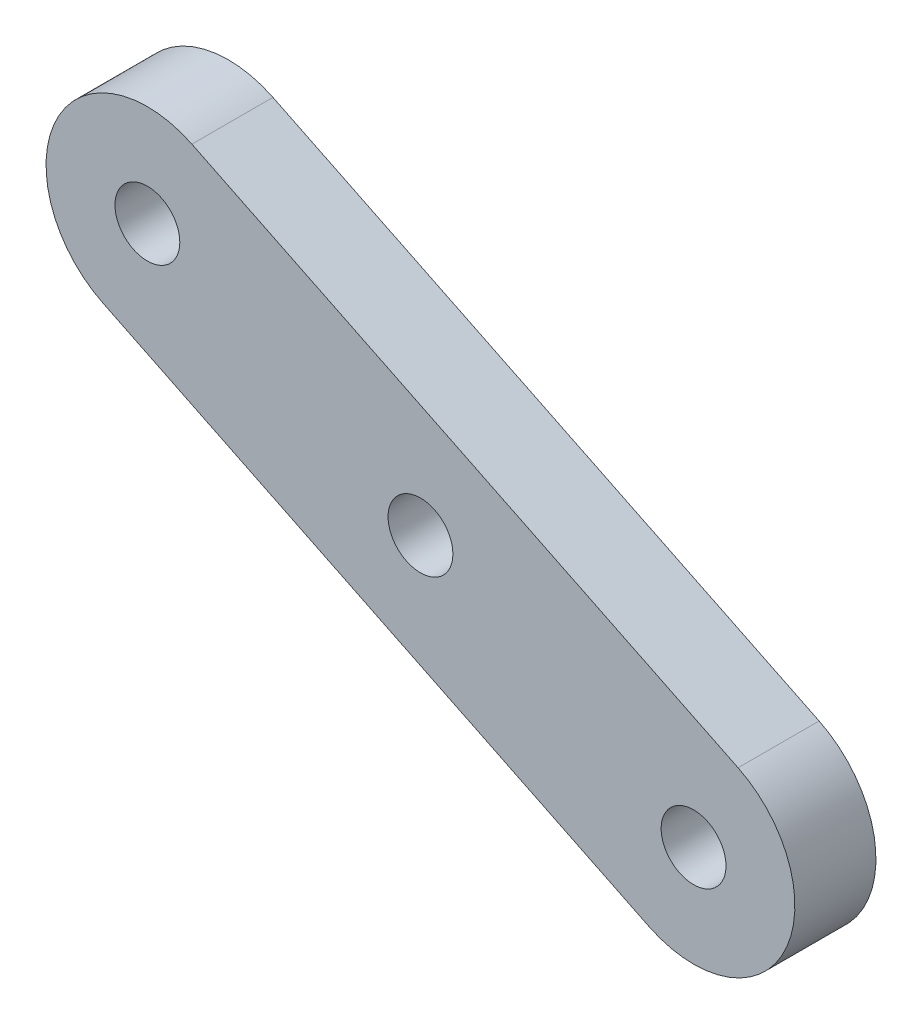
ISO-10303-21;
HEADER;
FILE_DESCRIPTION(('STEP AP214'),'2;1');
FILE_NAME('part.step','',(''),(''),'','','');
FILE_SCHEMA(('AUTOMOTIVE_DESIGN { 1 0 10303 214 1 1 1 1 }'));
ENDSEC;
DATA;
#1=APPLICATION_CONTEXT('core data for automotive mechanical design processes');
#2=APPLICATION_PROTOCOL_DEFINITION('international standard','automotive_design',2000,#1);
#3=PRODUCT_CONTEXT('',#1,'mechanical');
#4=PRODUCT('Part','Part','',(#3));
#5=PRODUCT_RELATED_PRODUCT_CATEGORY('part','',(#4));
#6=PRODUCT_DEFINITION_FORMATION('','',#4);
#7=PRODUCT_DEFINITION_CONTEXT('part definition',#1,'design');
#8=PRODUCT_DEFINITION('design','',#6,#7);
#9=PRODUCT_DEFINITION_SHAPE('','',#8);
#10=(LENGTH_UNIT() NAMED_UNIT(*) SI_UNIT(.MILLI.,.METRE.));
#11=(NAMED_UNIT(*) PLANE_ANGLE_UNIT() SI_UNIT($,.RADIAN.));
#12=(NAMED_UNIT(*) SI_UNIT($,.STERADIAN.) SOLID_ANGLE_UNIT());
#13=UNCERTAINTY_MEASURE_WITH_UNIT(LENGTH_MEASURE(1.E-05),#10,'distance_accuracy_value','');
#14=(GEOMETRIC_REPRESENTATION_CONTEXT(3) GLOBAL_UNCERTAINTY_ASSIGNED_CONTEXT((#13)) GLOBAL_UNIT_ASSIGNED_CONTEXT((#10,
#11,#12)) REPRESENTATION_CONTEXT('',''));
#15=CARTESIAN_POINT('',(0.,0.,0.));
#16=DIRECTION('',(0.,0.,1.));
#17=DIRECTION('',(1.,0.,0.));
#18=AXIS2_PLACEMENT_3D('',#15,#16,#17);
#19=CARTESIAN_POINT('',(0.,0.,4.));
#20=DIRECTION('',(0.,0.,1.));
#21=DIRECTION('',(1.,0.,0.));
#22=AXIS2_PLACEMENT_3D('',#19,#20,#21);
#23=PLANE('',#22);
#24=CARTESIAN_POINT('',(0.,0.,4.));
#25=DIRECTION('',(0.,0.,1.));
#26=DIRECTION('',(1.,0.,0.));
#27=AXIS2_PLACEMENT_3D('',#24,#25,#26);
#28=CIRCLE('',#27,1.6);
#29=CARTESIAN_POINT('',(1.60000000000001,0.,4.));
#30=VERTEX_POINT('',#29);
#31=EDGE_CURVE('E115',#30,#30,#28,.T.);
#32=ORIENTED_EDGE('',*,*,#31,.F.);
#33=EDGE_LOOP('',(#32));
#34=FACE_BOUND('',#33,.T.);
#35=CARTESIAN_POINT('',(0.,0.,4.));
#36=DIRECTION('',(0.,0.,1.));
#37=DIRECTION('',(1.,0.,0.));
#38=AXIS2_PLACEMENT_3D('',#35,#36,#37);
#39=CIRCLE('',#38,5.);
#40=CARTESIAN_POINT('',(-2.19568936266241,-4.4920984208598,4.));
#41=VERTEX_POINT('',#40);
#42=CARTESIAN_POINT('',(2.19568936266242,4.4920984208598,4.));
#43=VERTEX_POINT('',#42);
#44=EDGE_CURVE('E85',#41,#43,#39,.T.);
#45=ORIENTED_EDGE('',*,*,#44,.T.);
#46=DIRECTION('',(-0.898419684171961,0.439137872532482,0.));
#47=VECTOR('',#46,1.);
#48=CARTESIAN_POINT('',(2.19568936266242,4.4920984208598,4.));
#49=LINE('',#48,#47);
#50=CARTESIAN_POINT('',(-24.7569011624964,17.6662345968343,4.));
#51=VERTEX_POINT('',#50);
#52=EDGE_CURVE('E80',#43,#51,#49,.T.);
#53=ORIENTED_EDGE('',*,*,#52,.T.);
#54=CARTESIAN_POINT('',(-26.9525905251588,13.1741361759745,4.));
#55=DIRECTION('',(0.,0.,1.));
#56=DIRECTION('',(1.,0.,0.));
#57=AXIS2_PLACEMENT_3D('',#54,#55,#56);
#58=CIRCLE('',#57,4.99999999999999);
#59=CARTESIAN_POINT('',(-29.1482798878212,8.68203775511466,4.));
#60=VERTEX_POINT('',#59);
#61=EDGE_CURVE('E83',#51,#60,#58,.T.);
#62=ORIENTED_EDGE('',*,*,#61,.T.);
#63=DIRECTION('',(0.89841968417196,-0.439137872532482,0.));
#64=VECTOR('',#63,1.);
#65=CARTESIAN_POINT('',(-2.19568936266241,-4.4920984208598,4.));
#66=LINE('',#65,#64);
#67=EDGE_CURVE('E50',#60,#41,#66,.T.);
#68=ORIENTED_EDGE('',*,*,#67,.T.);
#69=EDGE_LOOP('',(#45,#53,#62,#68));
#70=FACE_BOUND('',#69,.T.);
#71=CARTESIAN_POINT('',(-26.9525905251588,13.1741361759745,4.));
#72=DIRECTION('',(0.,0.,1.));
#73=DIRECTION('',(1.,0.,0.));
#74=AXIS2_PLACEMENT_3D('',#71,#72,#73);
#75=CIRCLE('',#74,1.6);
#76=CARTESIAN_POINT('',(-25.3525905251588,13.1741361759745,4.));
#77=VERTEX_POINT('',#76);
#78=EDGE_CURVE('E100',#77,#77,#75,.T.);
#79=ORIENTED_EDGE('',*,*,#78,.F.);
#80=EDGE_LOOP('',(#79));
#81=FACE_BOUND('',#80,.T.);
#82=CARTESIAN_POINT('',(-13.4762952625794,6.58706808798723,4.));
#83=DIRECTION('',(0.,0.,1.));
#84=DIRECTION('',(1.,0.,0.));
#85=AXIS2_PLACEMENT_3D('',#82,#83,#84);
#86=CIRCLE('',#85,1.6);
#87=CARTESIAN_POINT('',(-11.8762952625794,6.58706808798723,4.));
#88=VERTEX_POINT('',#87);
#89=EDGE_CURVE('E121',#88,#88,#86,.T.);
#90=ORIENTED_EDGE('',*,*,#89,.F.);
#91=EDGE_LOOP('',(#90));
#92=FACE_BOUND('',#91,.T.);
#93=ADVANCED_FACE('F33',(#34,#70,#81,#92),#23,.T.);
#94=CARTESIAN_POINT('',(0.,0.,0.));
#95=DIRECTION('',(0.,0.,1.));
#96=DIRECTION('',(1.,0.,0.));
#97=AXIS2_PLACEMENT_3D('',#94,#95,#96);
#98=PLANE('',#97);
#99=CARTESIAN_POINT('',(0.,0.,0.));
#100=DIRECTION('',(0.,0.,1.));
#101=DIRECTION('',(1.,0.,0.));
#102=AXIS2_PLACEMENT_3D('',#99,#100,#101);
#103=CIRCLE('',#102,5.);
#104=CARTESIAN_POINT('',(-2.19568936266241,-4.4920984208598,0.));
#105=VERTEX_POINT('',#104);
#106=CARTESIAN_POINT('',(2.19568936266242,4.4920984208598,0.));
#107=VERTEX_POINT('',#106);
#108=EDGE_CURVE('E97',#105,#107,#103,.T.);
#109=ORIENTED_EDGE('',*,*,#108,.F.);
#110=DIRECTION('',(0.89841968417196,-0.439137872532482,0.));
#111=VECTOR('',#110,1.);
#112=CARTESIAN_POINT('',(-2.19568936266241,-4.4920984208598,0.));
#113=LINE('',#112,#111);
#114=CARTESIAN_POINT('',(-29.1482798878212,8.68203775511466,0.));
#115=VERTEX_POINT('',#114);
#116=EDGE_CURVE('E73',#115,#105,#113,.T.);
#117=ORIENTED_EDGE('',*,*,#116,.F.);
#118=CARTESIAN_POINT('',(-26.9525905251588,13.1741361759745,0.));
#119=DIRECTION('',(0.,0.,1.));
#120=DIRECTION('',(1.,0.,0.));
#121=AXIS2_PLACEMENT_3D('',#118,#119,#120);
#122=CIRCLE('',#121,4.99999999999999);
#123=CARTESIAN_POINT('',(-24.7569011624964,17.6662345968343,0.));
#124=VERTEX_POINT('',#123);
#125=EDGE_CURVE('E67',#124,#115,#122,.T.);
#126=ORIENTED_EDGE('',*,*,#125,.F.);
#127=DIRECTION('',(-0.898419684171961,0.439137872532482,0.));
#128=VECTOR('',#127,1.);
#129=CARTESIAN_POINT('',(2.19568936266242,4.4920984208598,0.));
#130=LINE('',#129,#128);
#131=EDGE_CURVE('E89',#107,#124,#130,.T.);
#132=ORIENTED_EDGE('',*,*,#131,.F.);
#133=EDGE_LOOP('',(#109,#117,#126,#132));
#134=FACE_BOUND('',#133,.T.);
#135=CARTESIAN_POINT('',(-26.9525905251588,13.1741361759745,0.));
#136=DIRECTION('',(0.,0.,1.));
#137=DIRECTION('',(1.,0.,0.));
#138=AXIS2_PLACEMENT_3D('',#135,#136,#137);
#139=CIRCLE('',#138,1.6);
#140=CARTESIAN_POINT('',(-25.3525905251588,13.1741361759745,0.));
#141=VERTEX_POINT('',#140);
#142=EDGE_CURVE('E112',#141,#141,#139,.T.);
#143=ORIENTED_EDGE('',*,*,#142,.T.);
#144=EDGE_LOOP('',(#143));
#145=FACE_BOUND('',#144,.T.);
#146=CARTESIAN_POINT('',(0.,0.,0.));
#147=DIRECTION('',(0.,0.,1.));
#148=DIRECTION('',(1.,0.,0.));
#149=AXIS2_PLACEMENT_3D('',#146,#147,#148);
#150=CIRCLE('',#149,1.6);
#151=CARTESIAN_POINT('',(1.60000000000001,0.,0.));
#152=VERTEX_POINT('',#151);
#153=EDGE_CURVE('E118',#152,#152,#150,.T.);
#154=ORIENTED_EDGE('',*,*,#153,.T.);
#155=EDGE_LOOP('',(#154));
#156=FACE_BOUND('',#155,.T.);
#157=CARTESIAN_POINT('',(-13.4762952625794,6.58706808798723,0.));
#158=DIRECTION('',(0.,0.,1.));
#159=DIRECTION('',(1.,0.,0.));
#160=AXIS2_PLACEMENT_3D('',#157,#158,#159);
#161=CIRCLE('',#160,1.6);
#162=CARTESIAN_POINT('',(-11.8762952625794,6.58706808798723,0.));
#163=VERTEX_POINT('',#162);
#164=EDGE_CURVE('E124',#163,#163,#161,.T.);
#165=ORIENTED_EDGE('',*,*,#164,.T.);
#166=EDGE_LOOP('',(#165));
#167=FACE_BOUND('',#166,.T.);
#168=ADVANCED_FACE('F108',(#134,#145,#156,#167),#98,.F.);
#169=CARTESIAN_POINT('',(0.,0.,4.));
#170=DIRECTION('',(0.,0.,-1.));
#171=DIRECTION('',(-1.,0.,0.));
#172=AXIS2_PLACEMENT_3D('',#169,#170,#171);
#173=CYLINDRICAL_SURFACE('',#172,5.);
#174=ORIENTED_EDGE('',*,*,#108,.T.);
#175=DIRECTION('',(0.,0.,-1.));
#176=VECTOR('',#175,1.);
#177=CARTESIAN_POINT('',(2.19568936266242,4.4920984208598,4.));
#178=LINE('',#177,#176);
#179=EDGE_CURVE('E11',#43,#107,#178,.T.);
#180=ORIENTED_EDGE('',*,*,#179,.F.);
#181=ORIENTED_EDGE('',*,*,#44,.F.);
#182=DIRECTION('',(0.,0.,-1.));
#183=VECTOR('',#182,1.);
#184=CARTESIAN_POINT('',(-2.19568936266241,-4.4920984208598,4.));
#185=LINE('',#184,#183);
#186=EDGE_CURVE('E93',#41,#105,#185,.T.);
#187=ORIENTED_EDGE('',*,*,#186,.T.);
#188=EDGE_LOOP('',(#174,#180,#181,#187));
#189=FACE_BOUND('',#188,.T.);
#190=ADVANCED_FACE('F35',(#189),#173,.T.);
#191=CARTESIAN_POINT('',(2.19568936266242,4.4920984208598,4.));
#192=DIRECTION('',(-0.439137872532482,-0.898419684171961,0.));
#193=DIRECTION('',(0.898419684171961,-0.439137872532482,0.));
#194=AXIS2_PLACEMENT_3D('',#191,#192,#193);
#195=PLANE('',#194);
#196=ORIENTED_EDGE('',*,*,#131,.T.);
#197=DIRECTION('',(0.,0.,-1.));
#198=VECTOR('',#197,1.);
#199=CARTESIAN_POINT('',(-24.7569011624964,17.6662345968343,4.));
#200=LINE('',#199,#198);
#201=EDGE_CURVE('E42',#51,#124,#200,.T.);
#202=ORIENTED_EDGE('',*,*,#201,.F.);
#203=ORIENTED_EDGE('',*,*,#52,.F.);
#204=ORIENTED_EDGE('',*,*,#179,.T.);
#205=EDGE_LOOP('',(#196,#202,#203,#204));
#206=FACE_BOUND('',#205,.T.);
#207=ADVANCED_FACE('F88',(#206),#195,.F.);
#208=CARTESIAN_POINT('',(-26.9525905251588,13.1741361759745,4.));
#209=DIRECTION('',(0.,0.,-1.));
#210=DIRECTION('',(-1.,0.,0.));
#211=AXIS2_PLACEMENT_3D('',#208,#209,#210);
#212=CYLINDRICAL_SURFACE('',#211,4.99999999999999);
#213=ORIENTED_EDGE('',*,*,#125,.T.);
#214=DIRECTION('',(0.,0.,-1.));
#215=VECTOR('',#214,1.);
#216=CARTESIAN_POINT('',(-29.1482798878212,8.68203775511466,4.));
#217=LINE('',#216,#215);
#218=EDGE_CURVE('E90',#60,#115,#217,.T.);
#219=ORIENTED_EDGE('',*,*,#218,.F.);
#220=ORIENTED_EDGE('',*,*,#61,.F.);
#221=ORIENTED_EDGE('',*,*,#201,.T.);
#222=EDGE_LOOP('',(#213,#219,#220,#221));
#223=FACE_BOUND('',#222,.T.);
#224=ADVANCED_FACE('F91',(#223),#212,.T.);
#225=CARTESIAN_POINT('',(-2.19568936266241,-4.4920984208598,4.));
#226=DIRECTION('',(0.439137872532482,0.898419684171961,0.));
#227=DIRECTION('',(-0.898419684171961,0.439137872532482,0.));
#228=AXIS2_PLACEMENT_3D('',#225,#226,#227);
#229=PLANE('',#228);
#230=ORIENTED_EDGE('',*,*,#116,.T.);
#231=ORIENTED_EDGE('',*,*,#186,.F.);
#232=ORIENTED_EDGE('',*,*,#67,.F.);
#233=ORIENTED_EDGE('',*,*,#218,.T.);
#234=EDGE_LOOP('',(#230,#231,#232,#233));
#235=FACE_BOUND('',#234,.T.);
#236=ADVANCED_FACE('F105',(#235),#229,.F.);
#237=CARTESIAN_POINT('',(-26.9525905251588,13.1741361759745,4.));
#238=DIRECTION('',(0.,0.,-1.));
#239=DIRECTION('',(-1.,0.,0.));
#240=AXIS2_PLACEMENT_3D('',#237,#238,#239);
#241=CYLINDRICAL_SURFACE('',#240,1.6);
#242=ORIENTED_EDGE('',*,*,#78,.T.);
#243=EDGE_LOOP('',(#242));
#244=FACE_BOUND('',#243,.T.);
#245=ORIENTED_EDGE('',*,*,#142,.F.);
#246=EDGE_LOOP('',(#245));
#247=FACE_BOUND('',#246,.T.);
#248=ADVANCED_FACE('F142',(#244,#247),#241,.F.);
#249=CARTESIAN_POINT('',(0.,0.,4.));
#250=DIRECTION('',(0.,0.,-1.));
#251=DIRECTION('',(-1.,0.,0.));
#252=AXIS2_PLACEMENT_3D('',#249,#250,#251);
#253=CYLINDRICAL_SURFACE('',#252,1.6);
#254=ORIENTED_EDGE('',*,*,#31,.T.);
#255=EDGE_LOOP('',(#254));
#256=FACE_BOUND('',#255,.T.);
#257=ORIENTED_EDGE('',*,*,#153,.F.);
#258=EDGE_LOOP('',(#257));
#259=FACE_BOUND('',#258,.T.);
#260=ADVANCED_FACE('F188',(#256,#259),#253,.F.);
#261=CARTESIAN_POINT('',(-13.4762952625794,6.58706808798723,4.));
#262=DIRECTION('',(0.,0.,-1.));
#263=DIRECTION('',(-1.,0.,0.));
#264=AXIS2_PLACEMENT_3D('',#261,#262,#263);
#265=CYLINDRICAL_SURFACE('',#264,1.6);
#266=ORIENTED_EDGE('',*,*,#89,.T.);
#267=EDGE_LOOP('',(#266));
#268=FACE_BOUND('',#267,.T.);
#269=ORIENTED_EDGE('',*,*,#164,.F.);
#270=EDGE_LOOP('',(#269));
#271=FACE_BOUND('',#270,.T.);
#272=ADVANCED_FACE('F130',(#268,#271),#265,.F.);
#273=CLOSED_SHELL('',(#93,#168,#190,#207,#224,#236,#248,#260,#272));
#274=MANIFOLD_SOLID_BREP('B2',#273);
#275=ADVANCED_BREP_SHAPE_REPRESENTATION('',(#18,#274),#14);
#276=SHAPE_DEFINITION_REPRESENTATION(#9,#275);
ENDSEC;
END-ISO-10303-21;
